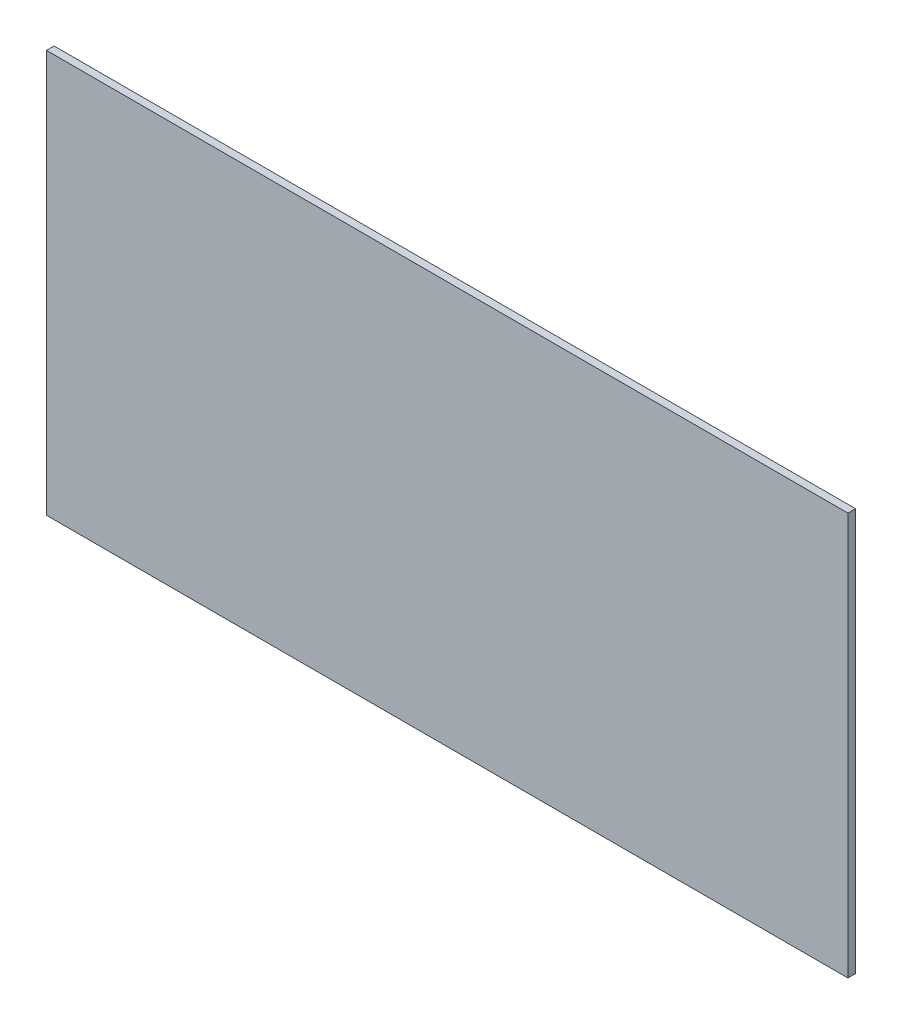
ISO-10303-21;
HEADER;
FILE_DESCRIPTION(('STEP AP214'),'2;1');
FILE_NAME('part.step','',(''),(''),'','','');
FILE_SCHEMA(('AUTOMOTIVE_DESIGN { 1 0 10303 214 1 1 1 1 }'));
ENDSEC;
DATA;
#1=APPLICATION_CONTEXT('core data for automotive mechanical design processes');
#2=APPLICATION_PROTOCOL_DEFINITION('international standard','automotive_design',2000,#1);
#3=PRODUCT_CONTEXT('',#1,'mechanical');
#4=PRODUCT('Part','Part','',(#3));
#5=PRODUCT_RELATED_PRODUCT_CATEGORY('part','',(#4));
#6=PRODUCT_DEFINITION_FORMATION('','',#4);
#7=PRODUCT_DEFINITION_CONTEXT('part definition',#1,'design');
#8=PRODUCT_DEFINITION('design','',#6,#7);
#9=PRODUCT_DEFINITION_SHAPE('','',#8);
#10=(LENGTH_UNIT() NAMED_UNIT(*) SI_UNIT(.MILLI.,.METRE.));
#11=(NAMED_UNIT(*) PLANE_ANGLE_UNIT() SI_UNIT($,.RADIAN.));
#12=(NAMED_UNIT(*) SI_UNIT($,.STERADIAN.) SOLID_ANGLE_UNIT());
#13=UNCERTAINTY_MEASURE_WITH_UNIT(LENGTH_MEASURE(1.E-05),#10,'distance_accuracy_value','');
#14=(GEOMETRIC_REPRESENTATION_CONTEXT(3) GLOBAL_UNCERTAINTY_ASSIGNED_CONTEXT((#13)) GLOBAL_UNIT_ASSIGNED_CONTEXT((#10,
#11,#12)) REPRESENTATION_CONTEXT('',''));
#15=CARTESIAN_POINT('',(0.,0.,0.));
#16=DIRECTION('',(0.,0.,1.));
#17=DIRECTION('',(1.,0.,0.));
#18=AXIS2_PLACEMENT_3D('',#15,#16,#17);
#19=CARTESIAN_POINT('',(29.8203526658836,195.818577882488,0.127000000000044));
#20=DIRECTION('',(-1.00000000000001,0.,0.));
#21=DIRECTION('',(0.,0.,1.00000000000003));
#22=AXIS2_PLACEMENT_3D('',#19,#20,#21);
#23=PLANE('',#22);
#24=DIRECTION('',(0.,0.999999999999994,0.));
#25=VECTOR('',#24,1.);
#26=CARTESIAN_POINT('',(29.8203526658836,195.818577882488,1.11022302462516E-13));
#27=LINE('',#26,#25);
#28=CARTESIAN_POINT('',(29.8203526658836,195.818577882488,1.11022302462516E-13));
#29=VERTEX_POINT('',#28);
#30=CARTESIAN_POINT('',(29.8203526658835,202.549577882489,1.11022302462516E-13));
#31=VERTEX_POINT('',#30);
#32=EDGE_CURVE('E97',#29,#31,#27,.T.);
#33=ORIENTED_EDGE('',*,*,#32,.T.);
#34=DIRECTION('',(0.,0.,-1.00000000000003));
#35=VECTOR('',#34,1.);
#36=CARTESIAN_POINT('',(29.8203526658835,202.549577882489,0.127000000000099));
#37=LINE('',#36,#35);
#38=CARTESIAN_POINT('',(29.8203526658835,202.549577882489,0.127000000000099));
#39=VERTEX_POINT('',#38);
#40=EDGE_CURVE('E11',#39,#31,#37,.T.);
#41=ORIENTED_EDGE('',*,*,#40,.F.);
#42=DIRECTION('',(0.,0.999999999999994,0.));
#43=VECTOR('',#42,1.);
#44=CARTESIAN_POINT('',(29.8203526658836,195.818577882488,0.127000000000044));
#45=LINE('',#44,#43);
#46=CARTESIAN_POINT('',(29.8203526658836,195.818577882488,0.127000000000044));
#47=VERTEX_POINT('',#46);
#48=EDGE_CURVE('E85',#47,#39,#45,.T.);
#49=ORIENTED_EDGE('',*,*,#48,.F.);
#50=DIRECTION('',(0.,0.,-1.00000000000003));
#51=VECTOR('',#50,1.);
#52=CARTESIAN_POINT('',(29.8203526658836,195.818577882488,0.127000000000044));
#53=LINE('',#52,#51);
#54=EDGE_CURVE('E93',#47,#29,#53,.T.);
#55=ORIENTED_EDGE('',*,*,#54,.T.);
#56=EDGE_LOOP('',(#33,#41,#49,#55));
#57=FACE_BOUND('',#56,.T.);
#58=ADVANCED_FACE('F34',(#57),#23,.F.);
#59=CARTESIAN_POINT('',(29.8203526658835,202.549577882489,0.127000000000099));
#60=DIRECTION('',(0.,-0.999999999999994,0.));
#61=DIRECTION('',(0.,0.,-1.00000000000003));
#62=AXIS2_PLACEMENT_3D('',#59,#60,#61);
#63=PLANE('',#62);
#64=DIRECTION('',(-1.00000000000001,0.,0.));
#65=VECTOR('',#64,1.);
#66=CARTESIAN_POINT('',(29.8203526658835,202.549577882489,1.11022302462516E-13));
#67=LINE('',#66,#65);
#68=CARTESIAN_POINT('',(16.4218526658838,202.549577882488,0.));
#69=VERTEX_POINT('',#68);
#70=EDGE_CURVE('E89',#31,#69,#67,.T.);
#71=ORIENTED_EDGE('',*,*,#70,.T.);
#72=DIRECTION('',(0.,0.,-1.00000000000003));
#73=VECTOR('',#72,1.);
#74=CARTESIAN_POINT('',(16.4218526658838,202.549577882488,0.127000000000044));
#75=LINE('',#74,#73);
#76=CARTESIAN_POINT('',(16.4218526658838,202.549577882488,0.127000000000044));
#77=VERTEX_POINT('',#76);
#78=EDGE_CURVE('E42',#77,#69,#75,.T.);
#79=ORIENTED_EDGE('',*,*,#78,.F.);
#80=DIRECTION('',(-1.00000000000001,0.,0.));
#81=VECTOR('',#80,1.);
#82=CARTESIAN_POINT('',(29.8203526658835,202.549577882489,0.127000000000099));
#83=LINE('',#82,#81);
#84=EDGE_CURVE('E80',#39,#77,#83,.T.);
#85=ORIENTED_EDGE('',*,*,#84,.F.);
#86=ORIENTED_EDGE('',*,*,#40,.T.);
#87=EDGE_LOOP('',(#71,#79,#85,#86));
#88=FACE_BOUND('',#87,.T.);
#89=ADVANCED_FACE('F88',(#88),#63,.F.);
#90=CARTESIAN_POINT('',(16.4218526658838,202.549577882488,0.127000000000044));
#91=DIRECTION('',(1.00000000000001,0.,0.));
#92=DIRECTION('',(0.,0.,-1.00000000000003));
#93=AXIS2_PLACEMENT_3D('',#90,#91,#92);
#94=PLANE('',#93);
#95=DIRECTION('',(0.,-0.999999999999994,0.));
#96=VECTOR('',#95,1.);
#97=CARTESIAN_POINT('',(16.4218526658838,202.549577882488,0.));
#98=LINE('',#97,#96);
#99=CARTESIAN_POINT('',(16.4218526658839,195.818577882487,0.));
#100=VERTEX_POINT('',#99);
#101=EDGE_CURVE('E67',#69,#100,#98,.T.);
#102=ORIENTED_EDGE('',*,*,#101,.T.);
#103=DIRECTION('',(0.,0.,-1.00000000000003));
#104=VECTOR('',#103,1.);
#105=CARTESIAN_POINT('',(16.4218526658839,195.818577882487,0.127000000000014));
#106=LINE('',#105,#104);
#107=CARTESIAN_POINT('',(16.4218526658839,195.818577882487,0.127000000000014));
#108=VERTEX_POINT('',#107);
#109=EDGE_CURVE('E90',#108,#100,#106,.T.);
#110=ORIENTED_EDGE('',*,*,#109,.F.);
#111=DIRECTION('',(0.,-0.999999999999994,0.));
#112=VECTOR('',#111,1.);
#113=CARTESIAN_POINT('',(16.4218526658838,202.549577882488,0.127000000000044));
#114=LINE('',#113,#112);
#115=EDGE_CURVE('E83',#77,#108,#114,.T.);
#116=ORIENTED_EDGE('',*,*,#115,.F.);
#117=ORIENTED_EDGE('',*,*,#78,.T.);
#118=EDGE_LOOP('',(#102,#110,#116,#117));
#119=FACE_BOUND('',#118,.T.);
#120=ADVANCED_FACE('F91',(#119),#94,.F.);
#121=CARTESIAN_POINT('',(16.4218526658839,195.818577882487,0.127000000000014));
#122=DIRECTION('',(0.,0.999999999999994,0.));
#123=DIRECTION('',(0.,0.,1.00000000000003));
#124=AXIS2_PLACEMENT_3D('',#121,#122,#123);
#125=PLANE('',#124);
#126=DIRECTION('',(1.00000000000001,0.,0.));
#127=VECTOR('',#126,1.);
#128=CARTESIAN_POINT('',(16.4218526658839,195.818577882487,0.));
#129=LINE('',#128,#127);
#130=EDGE_CURVE('E73',#100,#29,#129,.T.);
#131=ORIENTED_EDGE('',*,*,#130,.T.);
#132=ORIENTED_EDGE('',*,*,#54,.F.);
#133=DIRECTION('',(1.00000000000001,0.,0.));
#134=VECTOR('',#133,1.);
#135=CARTESIAN_POINT('',(16.4218526658839,195.818577882487,0.127000000000014));
#136=LINE('',#135,#134);
#137=EDGE_CURVE('E50',#108,#47,#136,.T.);
#138=ORIENTED_EDGE('',*,*,#137,.F.);
#139=ORIENTED_EDGE('',*,*,#109,.T.);
#140=EDGE_LOOP('',(#131,#132,#138,#139));
#141=FACE_BOUND('',#140,.T.);
#142=ADVANCED_FACE('F104',(#141),#125,.F.);
#143=CARTESIAN_POINT('',(0.,0.,0.127000000000044));
#144=DIRECTION('',(0.,0.,1.00000000000003));
#145=DIRECTION('',(1.00000000000001,0.,0.));
#146=AXIS2_PLACEMENT_3D('',#143,#144,#145);
#147=PLANE('',#146);
#148=ORIENTED_EDGE('',*,*,#48,.T.);
#149=ORIENTED_EDGE('',*,*,#84,.T.);
#150=ORIENTED_EDGE('',*,*,#115,.T.);
#151=ORIENTED_EDGE('',*,*,#137,.T.);
#152=EDGE_LOOP('',(#148,#149,#150,#151));
#153=FACE_BOUND('',#152,.T.);
#154=ADVANCED_FACE('F81',(#153),#147,.T.);
#155=CARTESIAN_POINT('',(0.,0.,0.));
#156=DIRECTION('',(0.,0.,1.00000000000003));
#157=DIRECTION('',(1.00000000000001,0.,0.));
#158=AXIS2_PLACEMENT_3D('',#155,#156,#157);
#159=PLANE('',#158);
#160=ORIENTED_EDGE('',*,*,#32,.F.);
#161=ORIENTED_EDGE('',*,*,#130,.F.);
#162=ORIENTED_EDGE('',*,*,#101,.F.);
#163=ORIENTED_EDGE('',*,*,#70,.F.);
#164=EDGE_LOOP('',(#160,#161,#162,#163));
#165=FACE_BOUND('',#164,.T.);
#166=ADVANCED_FACE('F107',(#165),#159,.F.);
#167=CLOSED_SHELL('',(#58,#89,#120,#142,#154,#166));
#168=MANIFOLD_SOLID_BREP('B2',#167);
#169=ADVANCED_BREP_SHAPE_REPRESENTATION('',(#18,#168),#14);
#170=SHAPE_DEFINITION_REPRESENTATION(#9,#169);
ENDSEC;
END-ISO-10303-21;
